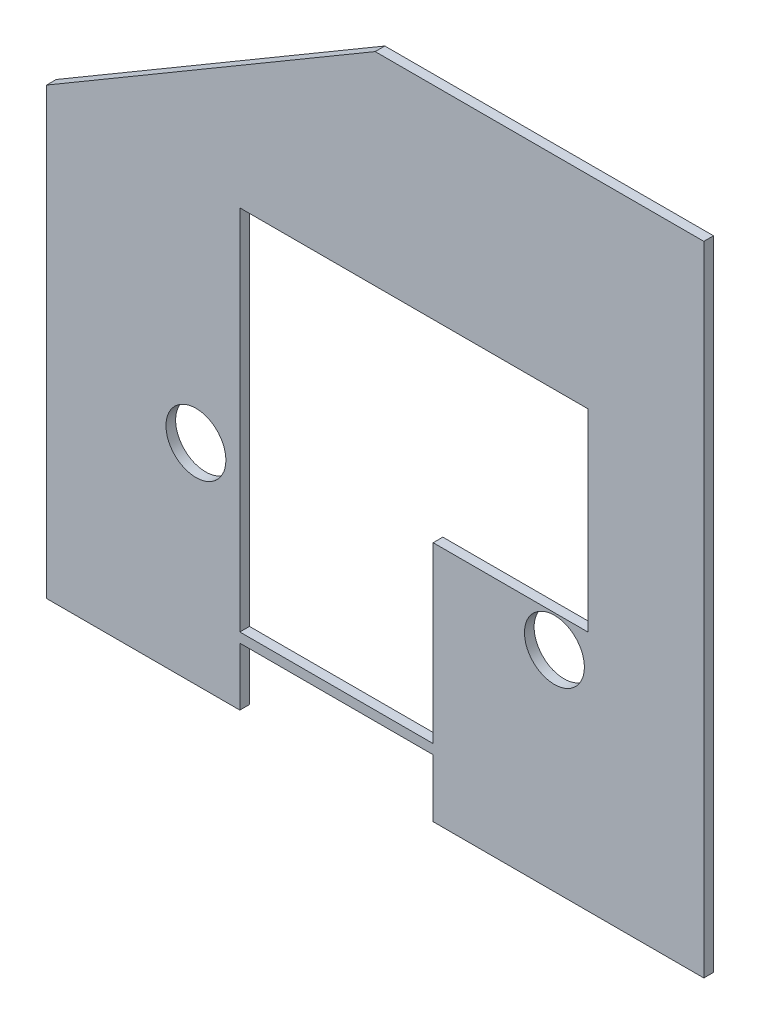
ISO-10303-21;
HEADER;
FILE_DESCRIPTION(('STEP AP214'),'2;1');
FILE_NAME('part.step','',(''),(''),'','','');
FILE_SCHEMA(('AUTOMOTIVE_DESIGN { 1 0 10303 214 1 1 1 1 }'));
ENDSEC;
DATA;
#1=APPLICATION_CONTEXT('core data for automotive mechanical design processes');
#2=APPLICATION_PROTOCOL_DEFINITION('international standard','automotive_design',2000,#1);
#3=PRODUCT_CONTEXT('',#1,'mechanical');
#4=PRODUCT('Part','Part','',(#3));
#5=PRODUCT_RELATED_PRODUCT_CATEGORY('part','',(#4));
#6=PRODUCT_DEFINITION_FORMATION('','',#4);
#7=PRODUCT_DEFINITION_CONTEXT('part definition',#1,'design');
#8=PRODUCT_DEFINITION('design','',#6,#7);
#9=PRODUCT_DEFINITION_SHAPE('','',#8);
#10=(LENGTH_UNIT() NAMED_UNIT(*) SI_UNIT(.MILLI.,.METRE.));
#11=(NAMED_UNIT(*) PLANE_ANGLE_UNIT() SI_UNIT($,.RADIAN.));
#12=(NAMED_UNIT(*) SI_UNIT($,.STERADIAN.) SOLID_ANGLE_UNIT());
#13=UNCERTAINTY_MEASURE_WITH_UNIT(LENGTH_MEASURE(1.E-05),#10,'distance_accuracy_value','');
#14=(GEOMETRIC_REPRESENTATION_CONTEXT(3) GLOBAL_UNCERTAINTY_ASSIGNED_CONTEXT((#13)) GLOBAL_UNIT_ASSIGNED_CONTEXT((#10,
#11,#12)) REPRESENTATION_CONTEXT('',''));
#15=CARTESIAN_POINT('',(0.,0.,0.));
#16=DIRECTION('',(0.,0.,1.));
#17=DIRECTION('',(1.,0.,0.));
#18=AXIS2_PLACEMENT_3D('',#15,#16,#17);
#19=CARTESIAN_POINT('',(431.8,12.7,6.35));
#20=DIRECTION('',(-1.,0.,0.));
#21=DIRECTION('',(0.,-1.,0.));
#22=AXIS2_PLACEMENT_3D('',#19,#20,#21);
#23=PLANE('',#22);
#24=DIRECTION('',(0.,1.,0.));
#25=VECTOR('',#24,1.);
#26=CARTESIAN_POINT('',(431.8,12.7,0.));
#27=LINE('',#26,#25);
#28=CARTESIAN_POINT('',(431.8,12.7,0.));
#29=VERTEX_POINT('',#28);
#30=CARTESIAN_POINT('',(431.8,431.8,0.));
#31=VERTEX_POINT('',#30);
#32=EDGE_CURVE('E203',#29,#31,#27,.T.);
#33=ORIENTED_EDGE('',*,*,#32,.T.);
#34=DIRECTION('',(0.,0.,-1.));
#35=VECTOR('',#34,1.);
#36=CARTESIAN_POINT('',(431.8,431.8,6.35));
#37=LINE('',#36,#35);
#38=CARTESIAN_POINT('',(431.8,431.8,6.35));
#39=VERTEX_POINT('',#38);
#40=EDGE_CURVE('E11',#39,#31,#37,.T.);
#41=ORIENTED_EDGE('',*,*,#40,.F.);
#42=DIRECTION('',(0.,1.,0.));
#43=VECTOR('',#42,1.);
#44=CARTESIAN_POINT('',(431.8,12.7,6.35));
#45=LINE('',#44,#43);
#46=CARTESIAN_POINT('',(431.8,12.7,6.35));
#47=VERTEX_POINT('',#46);
#48=EDGE_CURVE('E206',#47,#39,#45,.T.);
#49=ORIENTED_EDGE('',*,*,#48,.F.);
#50=DIRECTION('',(0.,0.,-1.));
#51=VECTOR('',#50,1.);
#52=CARTESIAN_POINT('',(431.8,12.7,6.35));
#53=LINE('',#52,#51);
#54=EDGE_CURVE('E226',#47,#29,#53,.T.);
#55=ORIENTED_EDGE('',*,*,#54,.T.);
#56=EDGE_LOOP('',(#33,#41,#49,#55));
#57=FACE_BOUND('',#56,.T.);
#58=ADVANCED_FACE('F35',(#57),#23,.F.);
#59=CARTESIAN_POINT('',(215.9,431.8,6.35));
#60=DIRECTION('',(0.,-1.,0.));
#61=DIRECTION('',(0.,0.,-1.));
#62=AXIS2_PLACEMENT_3D('',#59,#60,#61);
#63=PLANE('',#62);
#64=DIRECTION('',(-1.,0.,0.));
#65=VECTOR('',#64,1.);
#66=CARTESIAN_POINT('',(215.9,431.8,0.));
#67=LINE('',#66,#65);
#68=CARTESIAN_POINT('',(215.9,431.8,0.));
#69=VERTEX_POINT('',#68);
#70=EDGE_CURVE('E229',#31,#69,#67,.T.);
#71=ORIENTED_EDGE('',*,*,#70,.T.);
#72=DIRECTION('',(0.,0.,-1.));
#73=VECTOR('',#72,1.);
#74=CARTESIAN_POINT('',(215.9,431.8,6.35));
#75=LINE('',#74,#73);
#76=CARTESIAN_POINT('',(215.9,431.8,6.35));
#77=VERTEX_POINT('',#76);
#78=EDGE_CURVE('E42',#77,#69,#75,.T.);
#79=ORIENTED_EDGE('',*,*,#78,.F.);
#80=DIRECTION('',(-1.,0.,0.));
#81=VECTOR('',#80,1.);
#82=CARTESIAN_POINT('',(215.9,431.8,6.35));
#83=LINE('',#82,#81);
#84=EDGE_CURVE('E209',#39,#77,#83,.T.);
#85=ORIENTED_EDGE('',*,*,#84,.F.);
#86=ORIENTED_EDGE('',*,*,#40,.T.);
#87=EDGE_LOOP('',(#71,#79,#85,#86));
#88=FACE_BOUND('',#87,.T.);
#89=ADVANCED_FACE('F290',(#88),#63,.F.);
#90=CARTESIAN_POINT('',(0.,304.8,6.35));
#91=DIRECTION('',(0.507020126563394,-0.861934215157769,0.));
#92=DIRECTION('',(0.86193421515777,0.507020126563394,0.));
#93=AXIS2_PLACEMENT_3D('',#90,#91,#92);
#94=PLANE('',#93);
#95=DIRECTION('',(-0.861934215157769,-0.507020126563394,0.));
#96=VECTOR('',#95,1.);
#97=CARTESIAN_POINT('',(0.,304.8,0.));
#98=LINE('',#97,#96);
#99=CARTESIAN_POINT('',(0.,304.8,0.));
#100=VERTEX_POINT('',#99);
#101=EDGE_CURVE('E231',#69,#100,#98,.T.);
#102=ORIENTED_EDGE('',*,*,#101,.T.);
#103=DIRECTION('',(0.,0.,-1.));
#104=VECTOR('',#103,1.);
#105=CARTESIAN_POINT('',(0.,304.8,6.35));
#106=LINE('',#105,#104);
#107=CARTESIAN_POINT('',(0.,304.8,6.35));
#108=VERTEX_POINT('',#107);
#109=EDGE_CURVE('E261',#108,#100,#106,.T.);
#110=ORIENTED_EDGE('',*,*,#109,.F.);
#111=DIRECTION('',(-0.861934215157769,-0.507020126563394,0.));
#112=VECTOR('',#111,1.);
#113=CARTESIAN_POINT('',(0.,304.8,6.35));
#114=LINE('',#113,#112);
#115=EDGE_CURVE('E212',#77,#108,#114,.T.);
#116=ORIENTED_EDGE('',*,*,#115,.F.);
#117=ORIENTED_EDGE('',*,*,#78,.T.);
#118=EDGE_LOOP('',(#102,#110,#116,#117));
#119=FACE_BOUND('',#118,.T.);
#120=ADVANCED_FACE('F268',(#119),#94,.F.);
#121=CARTESIAN_POINT('',(0.,304.8,6.35));
#122=DIRECTION('',(1.,0.,0.));
#123=DIRECTION('',(0.,1.,0.));
#124=AXIS2_PLACEMENT_3D('',#121,#122,#123);
#125=PLANE('',#124);
#126=DIRECTION('',(0.,-1.,0.));
#127=VECTOR('',#126,1.);
#128=CARTESIAN_POINT('',(0.,304.8,0.));
#129=LINE('',#128,#127);
#130=CARTESIAN_POINT('',(0.,12.7,0.));
#131=VERTEX_POINT('',#130);
#132=EDGE_CURVE('E233',#100,#131,#129,.T.);
#133=ORIENTED_EDGE('',*,*,#132,.T.);
#134=DIRECTION('',(0.,0.,-1.));
#135=VECTOR('',#134,1.);
#136=CARTESIAN_POINT('',(0.,12.7,6.35));
#137=LINE('',#136,#135);
#138=CARTESIAN_POINT('',(0.,12.7,6.35));
#139=VERTEX_POINT('',#138);
#140=EDGE_CURVE('E258',#139,#131,#137,.T.);
#141=ORIENTED_EDGE('',*,*,#140,.F.);
#142=DIRECTION('',(0.,-1.,0.));
#143=VECTOR('',#142,1.);
#144=CARTESIAN_POINT('',(0.,304.8,6.35));
#145=LINE('',#144,#143);
#146=EDGE_CURVE('E214',#108,#139,#145,.T.);
#147=ORIENTED_EDGE('',*,*,#146,.F.);
#148=ORIENTED_EDGE('',*,*,#109,.T.);
#149=EDGE_LOOP('',(#133,#141,#147,#148));
#150=FACE_BOUND('',#149,.T.);
#151=ADVANCED_FACE('F278',(#150),#125,.F.);
#152=CARTESIAN_POINT('',(0.,12.7,6.35));
#153=DIRECTION('',(0.,1.,0.));
#154=DIRECTION('',(-1.,0.,0.));
#155=AXIS2_PLACEMENT_3D('',#152,#153,#154);
#156=PLANE('',#155);
#157=DIRECTION('',(1.,0.,0.));
#158=VECTOR('',#157,1.);
#159=CARTESIAN_POINT('',(0.,12.7,0.));
#160=LINE('',#159,#158);
#161=CARTESIAN_POINT('',(127.,12.7,0.));
#162=VERTEX_POINT('',#161);
#163=EDGE_CURVE('E235',#131,#162,#160,.T.);
#164=ORIENTED_EDGE('',*,*,#163,.T.);
#165=DIRECTION('',(0.,0.,-1.));
#166=VECTOR('',#165,1.);
#167=CARTESIAN_POINT('',(127.,12.7,6.35));
#168=LINE('',#167,#166);
#169=CARTESIAN_POINT('',(127.,12.7,6.35));
#170=VERTEX_POINT('',#169);
#171=EDGE_CURVE('E255',#170,#162,#168,.T.);
#172=ORIENTED_EDGE('',*,*,#171,.F.);
#173=DIRECTION('',(1.,0.,0.));
#174=VECTOR('',#173,1.);
#175=CARTESIAN_POINT('',(0.,12.7,6.35));
#176=LINE('',#175,#174);
#177=EDGE_CURVE('E216',#139,#170,#176,.T.);
#178=ORIENTED_EDGE('',*,*,#177,.F.);
#179=ORIENTED_EDGE('',*,*,#140,.T.);
#180=EDGE_LOOP('',(#164,#172,#178,#179));
#181=FACE_BOUND('',#180,.T.);
#182=ADVANCED_FACE('F282',(#181),#156,.F.);
#183=CARTESIAN_POINT('',(127.,12.7,6.35));
#184=DIRECTION('',(-1.,0.,0.));
#185=DIRECTION('',(0.,0.,1.));
#186=AXIS2_PLACEMENT_3D('',#183,#184,#185);
#187=PLANE('',#186);
#188=DIRECTION('',(0.,1.,0.));
#189=VECTOR('',#188,1.);
#190=CARTESIAN_POINT('',(127.,12.7,0.));
#191=LINE('',#190,#189);
#192=CARTESIAN_POINT('',(127.,50.8,0.));
#193=VERTEX_POINT('',#192);
#194=EDGE_CURVE('E237',#162,#193,#191,.T.);
#195=ORIENTED_EDGE('',*,*,#194,.T.);
#196=DIRECTION('',(0.,0.,-1.));
#197=VECTOR('',#196,1.);
#198=CARTESIAN_POINT('',(127.,50.8,6.35));
#199=LINE('',#198,#197);
#200=CARTESIAN_POINT('',(127.,50.8,6.35));
#201=VERTEX_POINT('',#200);
#202=EDGE_CURVE('E252',#201,#193,#199,.T.);
#203=ORIENTED_EDGE('',*,*,#202,.F.);
#204=DIRECTION('',(0.,1.,0.));
#205=VECTOR('',#204,1.);
#206=CARTESIAN_POINT('',(127.,12.7,6.35));
#207=LINE('',#206,#205);
#208=EDGE_CURVE('E218',#170,#201,#207,.T.);
#209=ORIENTED_EDGE('',*,*,#208,.F.);
#210=ORIENTED_EDGE('',*,*,#171,.T.);
#211=EDGE_LOOP('',(#195,#203,#209,#210));
#212=FACE_BOUND('',#211,.T.);
#213=ADVANCED_FACE('F308',(#212),#187,.F.);
#214=CARTESIAN_POINT('',(254.,50.8,6.35));
#215=DIRECTION('',(0.,1.,0.));
#216=DIRECTION('',(-1.,0.,0.));
#217=AXIS2_PLACEMENT_3D('',#214,#215,#216);
#218=PLANE('',#217);
#219=DIRECTION('',(1.,0.,0.));
#220=VECTOR('',#219,1.);
#221=CARTESIAN_POINT('',(254.,50.8,0.));
#222=LINE('',#221,#220);
#223=CARTESIAN_POINT('',(254.,50.8,0.));
#224=VERTEX_POINT('',#223);
#225=EDGE_CURVE('E239',#193,#224,#222,.T.);
#226=ORIENTED_EDGE('',*,*,#225,.T.);
#227=DIRECTION('',(0.,0.,-1.));
#228=VECTOR('',#227,1.);
#229=CARTESIAN_POINT('',(254.,50.8,6.35));
#230=LINE('',#229,#228);
#231=CARTESIAN_POINT('',(254.,50.8,6.35));
#232=VERTEX_POINT('',#231);
#233=EDGE_CURVE('E249',#232,#224,#230,.T.);
#234=ORIENTED_EDGE('',*,*,#233,.F.);
#235=DIRECTION('',(1.,0.,0.));
#236=VECTOR('',#235,1.);
#237=CARTESIAN_POINT('',(254.,50.8,6.35));
#238=LINE('',#237,#236);
#239=EDGE_CURVE('E220',#201,#232,#238,.T.);
#240=ORIENTED_EDGE('',*,*,#239,.F.);
#241=ORIENTED_EDGE('',*,*,#202,.T.);
#242=EDGE_LOOP('',(#226,#234,#240,#241));
#243=FACE_BOUND('',#242,.T.);
#244=ADVANCED_FACE('F306',(#243),#218,.F.);
#245=CARTESIAN_POINT('',(254.,50.8,6.35));
#246=DIRECTION('',(1.,0.,0.));
#247=DIRECTION('',(0.,1.,0.));
#248=AXIS2_PLACEMENT_3D('',#245,#246,#247);
#249=PLANE('',#248);
#250=DIRECTION('',(0.,-1.,0.));
#251=VECTOR('',#250,1.);
#252=CARTESIAN_POINT('',(254.,50.8,0.));
#253=LINE('',#252,#251);
#254=CARTESIAN_POINT('',(254.,12.7,0.));
#255=VERTEX_POINT('',#254);
#256=EDGE_CURVE('E241',#224,#255,#253,.T.);
#257=ORIENTED_EDGE('',*,*,#256,.T.);
#258=DIRECTION('',(0.,0.,-1.));
#259=VECTOR('',#258,1.);
#260=CARTESIAN_POINT('',(254.,12.7,6.35));
#261=LINE('',#260,#259);
#262=CARTESIAN_POINT('',(254.,12.7,6.35));
#263=VERTEX_POINT('',#262);
#264=EDGE_CURVE('E246',#263,#255,#261,.T.);
#265=ORIENTED_EDGE('',*,*,#264,.F.);
#266=DIRECTION('',(0.,-1.,0.));
#267=VECTOR('',#266,1.);
#268=CARTESIAN_POINT('',(254.,50.8,6.35));
#269=LINE('',#268,#267);
#270=EDGE_CURVE('E222',#232,#263,#269,.T.);
#271=ORIENTED_EDGE('',*,*,#270,.F.);
#272=ORIENTED_EDGE('',*,*,#233,.T.);
#273=EDGE_LOOP('',(#257,#265,#271,#272));
#274=FACE_BOUND('',#273,.T.);
#275=ADVANCED_FACE('F302',(#274),#249,.F.);
#276=CARTESIAN_POINT('',(254.,12.7,6.35));
#277=DIRECTION('',(0.,1.,0.));
#278=DIRECTION('',(-1.,0.,0.));
#279=AXIS2_PLACEMENT_3D('',#276,#277,#278);
#280=PLANE('',#279);
#281=DIRECTION('',(1.,0.,0.));
#282=VECTOR('',#281,1.);
#283=CARTESIAN_POINT('',(254.,12.7,0.));
#284=LINE('',#283,#282);
#285=EDGE_CURVE('E210',#255,#29,#284,.T.);
#286=ORIENTED_EDGE('',*,*,#285,.T.);
#287=ORIENTED_EDGE('',*,*,#54,.F.);
#288=DIRECTION('',(1.,0.,0.));
#289=VECTOR('',#288,1.);
#290=CARTESIAN_POINT('',(254.,12.7,6.35));
#291=LINE('',#290,#289);
#292=EDGE_CURVE('E224',#263,#47,#291,.T.);
#293=ORIENTED_EDGE('',*,*,#292,.F.);
#294=ORIENTED_EDGE('',*,*,#264,.T.);
#295=EDGE_LOOP('',(#286,#287,#293,#294));
#296=FACE_BOUND('',#295,.T.);
#297=ADVANCED_FACE('F297',(#296),#280,.F.);
#298=CARTESIAN_POINT('',(0.,0.,6.35));
#299=DIRECTION('',(0.,0.,-1.));
#300=DIRECTION('',(-1.,0.,0.));
#301=AXIS2_PLACEMENT_3D('',#298,#299,#300);
#302=PLANE('',#301);
#303=DIRECTION('',(0.,-1.,0.));
#304=VECTOR('',#303,1.);
#305=CARTESIAN_POINT('',(127.,298.45,6.35));
#306=LINE('',#305,#304);
#307=CARTESIAN_POINT('',(127.,298.45,6.35));
#308=VERTEX_POINT('',#307);
#309=CARTESIAN_POINT('',(127.,57.15,6.35));
#310=VERTEX_POINT('',#309);
#311=EDGE_CURVE('E174',#308,#310,#306,.T.);
#312=ORIENTED_EDGE('',*,*,#311,.F.);
#313=DIRECTION('',(-1.,0.,0.));
#314=VECTOR('',#313,1.);
#315=CARTESIAN_POINT('',(355.6,298.45,6.35));
#316=LINE('',#315,#314);
#317=CARTESIAN_POINT('',(355.6,298.45,6.35));
#318=VERTEX_POINT('',#317);
#319=EDGE_CURVE('E49',#318,#308,#316,.T.);
#320=ORIENTED_EDGE('',*,*,#319,.F.);
#321=DIRECTION('',(0.,1.,0.));
#322=VECTOR('',#321,1.);
#323=CARTESIAN_POINT('',(355.6,171.45,6.35));
#324=LINE('',#323,#322);
#325=CARTESIAN_POINT('',(355.6,171.45,6.35));
#326=VERTEX_POINT('',#325);
#327=EDGE_CURVE('E160',#326,#318,#324,.T.);
#328=ORIENTED_EDGE('',*,*,#327,.F.);
#329=DIRECTION('',(1.,0.,0.));
#330=VECTOR('',#329,1.);
#331=CARTESIAN_POINT('',(254.,171.45,6.35));
#332=LINE('',#331,#330);
#333=CARTESIAN_POINT('',(254.,171.45,6.35));
#334=VERTEX_POINT('',#333);
#335=EDGE_CURVE('E163',#334,#326,#332,.T.);
#336=ORIENTED_EDGE('',*,*,#335,.F.);
#337=DIRECTION('',(0.,1.,0.));
#338=VECTOR('',#337,1.);
#339=CARTESIAN_POINT('',(254.,57.15,6.35));
#340=LINE('',#339,#338);
#341=CARTESIAN_POINT('',(254.,57.15,6.35));
#342=VERTEX_POINT('',#341);
#343=EDGE_CURVE('E179',#342,#334,#340,.T.);
#344=ORIENTED_EDGE('',*,*,#343,.F.);
#345=DIRECTION('',(1.,0.,0.));
#346=VECTOR('',#345,1.);
#347=CARTESIAN_POINT('',(127.,57.15,6.35));
#348=LINE('',#347,#346);
#349=EDGE_CURVE('E176',#310,#342,#348,.T.);
#350=ORIENTED_EDGE('',*,*,#349,.F.);
#351=EDGE_LOOP('',(#312,#320,#328,#336,#344,#350));
#352=FACE_BOUND('',#351,.T.);
#353=CARTESIAN_POINT('',(333.65,150.3,6.35));
#354=DIRECTION('',(0.,0.,1.));
#355=DIRECTION('',(1.,0.,0.));
#356=AXIS2_PLACEMENT_3D('',#353,#354,#355);
#357=CIRCLE('',#356,19.685);
#358=CARTESIAN_POINT('',(353.335,150.3,6.35));
#359=VERTEX_POINT('',#358);
#360=EDGE_CURVE('E186',#359,#359,#357,.T.);
#361=ORIENTED_EDGE('',*,*,#360,.F.);
#362=EDGE_LOOP('',(#361));
#363=FACE_BOUND('',#362,.T.);
#364=CARTESIAN_POINT('',(98.15,150.3,6.35));
#365=DIRECTION('',(0.,0.,1.));
#366=DIRECTION('',(1.,0.,0.));
#367=AXIS2_PLACEMENT_3D('',#364,#365,#366);
#368=CIRCLE('',#367,19.685);
#369=CARTESIAN_POINT('',(117.835,150.3,6.35));
#370=VERTEX_POINT('',#369);
#371=EDGE_CURVE('E197',#370,#370,#368,.T.);
#372=ORIENTED_EDGE('',*,*,#371,.F.);
#373=EDGE_LOOP('',(#372));
#374=FACE_BOUND('',#373,.T.);
#375=ORIENTED_EDGE('',*,*,#48,.T.);
#376=ORIENTED_EDGE('',*,*,#84,.T.);
#377=ORIENTED_EDGE('',*,*,#115,.T.);
#378=ORIENTED_EDGE('',*,*,#146,.T.);
#379=ORIENTED_EDGE('',*,*,#177,.T.);
#380=ORIENTED_EDGE('',*,*,#208,.T.);
#381=ORIENTED_EDGE('',*,*,#239,.T.);
#382=ORIENTED_EDGE('',*,*,#270,.T.);
#383=ORIENTED_EDGE('',*,*,#292,.T.);
#384=EDGE_LOOP('',(#375,#376,#377,#378,#379,#380,#381,#382,#383));
#385=FACE_BOUND('',#384,.T.);
#386=ADVANCED_FACE('F286',(#352,#363,#374,#385),#302,.F.);
#387=CARTESIAN_POINT('',(0.,0.,0.));
#388=DIRECTION('',(0.,0.,-1.));
#389=DIRECTION('',(-1.,0.,0.));
#390=AXIS2_PLACEMENT_3D('',#387,#388,#389);
#391=PLANE('',#390);
#392=DIRECTION('',(-1.,0.,0.));
#393=VECTOR('',#392,1.);
#394=CARTESIAN_POINT('',(355.6,298.45,0.));
#395=LINE('',#394,#393);
#396=CARTESIAN_POINT('',(355.6,298.45,0.));
#397=VERTEX_POINT('',#396);
#398=CARTESIAN_POINT('',(127.,298.45,0.));
#399=VERTEX_POINT('',#398);
#400=EDGE_CURVE('E143',#397,#399,#395,.T.);
#401=ORIENTED_EDGE('',*,*,#400,.T.);
#402=DIRECTION('',(0.,-1.,0.));
#403=VECTOR('',#402,1.);
#404=CARTESIAN_POINT('',(127.,298.45,0.));
#405=LINE('',#404,#403);
#406=CARTESIAN_POINT('',(127.,57.15,0.));
#407=VERTEX_POINT('',#406);
#408=EDGE_CURVE('E152',#399,#407,#405,.T.);
#409=ORIENTED_EDGE('',*,*,#408,.T.);
#410=DIRECTION('',(1.,0.,0.));
#411=VECTOR('',#410,1.);
#412=CARTESIAN_POINT('',(127.,57.15,0.));
#413=LINE('',#412,#411);
#414=CARTESIAN_POINT('',(254.,57.15,0.));
#415=VERTEX_POINT('',#414);
#416=EDGE_CURVE('E57',#407,#415,#413,.T.);
#417=ORIENTED_EDGE('',*,*,#416,.T.);
#418=DIRECTION('',(0.,1.,0.));
#419=VECTOR('',#418,1.);
#420=CARTESIAN_POINT('',(254.,57.15,0.));
#421=LINE('',#420,#419);
#422=CARTESIAN_POINT('',(254.,171.45,0.));
#423=VERTEX_POINT('',#422);
#424=EDGE_CURVE('E167',#415,#423,#421,.T.);
#425=ORIENTED_EDGE('',*,*,#424,.T.);
#426=DIRECTION('',(1.,0.,0.));
#427=VECTOR('',#426,1.);
#428=CARTESIAN_POINT('',(254.,171.45,0.));
#429=LINE('',#428,#427);
#430=CARTESIAN_POINT('',(355.6,171.45,0.));
#431=VERTEX_POINT('',#430);
#432=EDGE_CURVE('E170',#423,#431,#429,.T.);
#433=ORIENTED_EDGE('',*,*,#432,.T.);
#434=DIRECTION('',(0.,1.,0.));
#435=VECTOR('',#434,1.);
#436=CARTESIAN_POINT('',(355.6,171.45,0.));
#437=LINE('',#436,#435);
#438=EDGE_CURVE('E149',#431,#397,#437,.T.);
#439=ORIENTED_EDGE('',*,*,#438,.T.);
#440=EDGE_LOOP('',(#401,#409,#417,#425,#433,#439));
#441=FACE_BOUND('',#440,.T.);
#442=CARTESIAN_POINT('',(333.65,150.3,0.));
#443=DIRECTION('',(0.,0.,1.));
#444=DIRECTION('',(1.,0.,0.));
#445=AXIS2_PLACEMENT_3D('',#442,#443,#444);
#446=CIRCLE('',#445,19.685);
#447=CARTESIAN_POINT('',(353.335,150.3,0.));
#448=VERTEX_POINT('',#447);
#449=EDGE_CURVE('E194',#448,#448,#446,.T.);
#450=ORIENTED_EDGE('',*,*,#449,.T.);
#451=EDGE_LOOP('',(#450));
#452=FACE_BOUND('',#451,.T.);
#453=CARTESIAN_POINT('',(98.15,150.3,0.));
#454=DIRECTION('',(0.,0.,1.));
#455=DIRECTION('',(1.,0.,0.));
#456=AXIS2_PLACEMENT_3D('',#453,#454,#455);
#457=CIRCLE('',#456,19.685);
#458=CARTESIAN_POINT('',(117.835,150.3,0.));
#459=VERTEX_POINT('',#458);
#460=EDGE_CURVE('E200',#459,#459,#457,.T.);
#461=ORIENTED_EDGE('',*,*,#460,.T.);
#462=EDGE_LOOP('',(#461));
#463=FACE_BOUND('',#462,.T.);
#464=ORIENTED_EDGE('',*,*,#32,.F.);
#465=ORIENTED_EDGE('',*,*,#285,.F.);
#466=ORIENTED_EDGE('',*,*,#256,.F.);
#467=ORIENTED_EDGE('',*,*,#225,.F.);
#468=ORIENTED_EDGE('',*,*,#194,.F.);
#469=ORIENTED_EDGE('',*,*,#163,.F.);
#470=ORIENTED_EDGE('',*,*,#132,.F.);
#471=ORIENTED_EDGE('',*,*,#101,.F.);
#472=ORIENTED_EDGE('',*,*,#70,.F.);
#473=EDGE_LOOP('',(#464,#465,#466,#467,#468,#469,#470,#471,#472));
#474=FACE_BOUND('',#473,.T.);
#475=ADVANCED_FACE('F156',(#441,#452,#463,#474),#391,.T.);
#476=CARTESIAN_POINT('',(98.15,150.3,0.));
#477=DIRECTION('',(0.,0.,1.));
#478=DIRECTION('',(1.,0.,0.));
#479=AXIS2_PLACEMENT_3D('',#476,#477,#478);
#480=CYLINDRICAL_SURFACE('',#479,19.685);
#481=ORIENTED_EDGE('',*,*,#460,.F.);
#482=EDGE_LOOP('',(#481));
#483=FACE_BOUND('',#482,.T.);
#484=ORIENTED_EDGE('',*,*,#371,.T.);
#485=EDGE_LOOP('',(#484));
#486=FACE_BOUND('',#485,.T.);
#487=ADVANCED_FACE('F382',(#483,#486),#480,.F.);
#488=CARTESIAN_POINT('',(333.65,150.3,0.));
#489=DIRECTION('',(0.,0.,1.));
#490=DIRECTION('',(1.,0.,0.));
#491=AXIS2_PLACEMENT_3D('',#488,#489,#490);
#492=CYLINDRICAL_SURFACE('',#491,19.685);
#493=ORIENTED_EDGE('',*,*,#449,.F.);
#494=EDGE_LOOP('',(#493));
#495=FACE_BOUND('',#494,.T.);
#496=ORIENTED_EDGE('',*,*,#360,.T.);
#497=EDGE_LOOP('',(#496));
#498=FACE_BOUND('',#497,.T.);
#499=ADVANCED_FACE('F390',(#495,#498),#492,.F.);
#500=CARTESIAN_POINT('',(355.6,298.45,0.));
#501=DIRECTION('',(0.,1.,0.));
#502=DIRECTION('',(-1.,0.,0.));
#503=AXIS2_PLACEMENT_3D('',#500,#501,#502);
#504=PLANE('',#503);
#505=ORIENTED_EDGE('',*,*,#319,.T.);
#506=DIRECTION('',(0.,0.,1.));
#507=VECTOR('',#506,1.);
#508=CARTESIAN_POINT('',(127.,298.45,0.));
#509=LINE('',#508,#507);
#510=EDGE_CURVE('E139',#399,#308,#509,.T.);
#511=ORIENTED_EDGE('',*,*,#510,.F.);
#512=ORIENTED_EDGE('',*,*,#400,.F.);
#513=DIRECTION('',(0.,0.,1.));
#514=VECTOR('',#513,1.);
#515=CARTESIAN_POINT('',(355.6,298.45,0.));
#516=LINE('',#515,#514);
#517=EDGE_CURVE('E184',#397,#318,#516,.T.);
#518=ORIENTED_EDGE('',*,*,#517,.T.);
#519=EDGE_LOOP('',(#505,#511,#512,#518));
#520=FACE_BOUND('',#519,.T.);
#521=ADVANCED_FACE('F141',(#520),#504,.F.);
#522=CARTESIAN_POINT('',(355.6,171.45,0.));
#523=DIRECTION('',(1.,0.,0.));
#524=DIRECTION('',(0.,0.,-1.));
#525=AXIS2_PLACEMENT_3D('',#522,#523,#524);
#526=PLANE('',#525);
#527=ORIENTED_EDGE('',*,*,#327,.T.);
#528=ORIENTED_EDGE('',*,*,#517,.F.);
#529=ORIENTED_EDGE('',*,*,#438,.F.);
#530=DIRECTION('',(0.,0.,1.));
#531=VECTOR('',#530,1.);
#532=CARTESIAN_POINT('',(355.6,171.45,0.));
#533=LINE('',#532,#531);
#534=EDGE_CURVE('E187',#431,#326,#533,.T.);
#535=ORIENTED_EDGE('',*,*,#534,.T.);
#536=EDGE_LOOP('',(#527,#528,#529,#535));
#537=FACE_BOUND('',#536,.T.);
#538=ADVANCED_FACE('F410',(#537),#526,.F.);
#539=CARTESIAN_POINT('',(254.,171.45,0.));
#540=DIRECTION('',(0.,-1.,0.));
#541=DIRECTION('',(0.,0.,-1.));
#542=AXIS2_PLACEMENT_3D('',#539,#540,#541);
#543=PLANE('',#542);
#544=ORIENTED_EDGE('',*,*,#335,.T.);
#545=ORIENTED_EDGE('',*,*,#534,.F.);
#546=ORIENTED_EDGE('',*,*,#432,.F.);
#547=DIRECTION('',(0.,0.,1.));
#548=VECTOR('',#547,1.);
#549=CARTESIAN_POINT('',(254.,171.45,0.));
#550=LINE('',#549,#548);
#551=EDGE_CURVE('E189',#423,#334,#550,.T.);
#552=ORIENTED_EDGE('',*,*,#551,.T.);
#553=EDGE_LOOP('',(#544,#545,#546,#552));
#554=FACE_BOUND('',#553,.T.);
#555=ADVANCED_FACE('F418',(#554),#543,.F.);
#556=CARTESIAN_POINT('',(254.,57.15,0.));
#557=DIRECTION('',(1.,0.,0.));
#558=DIRECTION('',(0.,0.,-1.));
#559=AXIS2_PLACEMENT_3D('',#556,#557,#558);
#560=PLANE('',#559);
#561=ORIENTED_EDGE('',*,*,#343,.T.);
#562=ORIENTED_EDGE('',*,*,#551,.F.);
#563=ORIENTED_EDGE('',*,*,#424,.F.);
#564=DIRECTION('',(0.,0.,1.));
#565=VECTOR('',#564,1.);
#566=CARTESIAN_POINT('',(254.,57.15,0.));
#567=LINE('',#566,#565);
#568=EDGE_CURVE('E191',#415,#342,#567,.T.);
#569=ORIENTED_EDGE('',*,*,#568,.T.);
#570=EDGE_LOOP('',(#561,#562,#563,#569));
#571=FACE_BOUND('',#570,.T.);
#572=ADVANCED_FACE('F427',(#571),#560,.F.);
#573=CARTESIAN_POINT('',(127.,57.15,0.));
#574=DIRECTION('',(0.,-1.,0.));
#575=DIRECTION('',(0.,0.,-1.));
#576=AXIS2_PLACEMENT_3D('',#573,#574,#575);
#577=PLANE('',#576);
#578=ORIENTED_EDGE('',*,*,#349,.T.);
#579=ORIENTED_EDGE('',*,*,#568,.F.);
#580=ORIENTED_EDGE('',*,*,#416,.F.);
#581=DIRECTION('',(0.,0.,1.));
#582=VECTOR('',#581,1.);
#583=CARTESIAN_POINT('',(127.,57.15,0.));
#584=LINE('',#583,#582);
#585=EDGE_CURVE('E148',#407,#310,#584,.T.);
#586=ORIENTED_EDGE('',*,*,#585,.T.);
#587=EDGE_LOOP('',(#578,#579,#580,#586));
#588=FACE_BOUND('',#587,.T.);
#589=ADVANCED_FACE('F436',(#588),#577,.F.);
#590=CARTESIAN_POINT('',(127.,298.45,0.));
#591=DIRECTION('',(-1.,0.,0.));
#592=DIRECTION('',(0.,-1.,0.));
#593=AXIS2_PLACEMENT_3D('',#590,#591,#592);
#594=PLANE('',#593);
#595=ORIENTED_EDGE('',*,*,#311,.T.);
#596=ORIENTED_EDGE('',*,*,#585,.F.);
#597=ORIENTED_EDGE('',*,*,#408,.F.);
#598=ORIENTED_EDGE('',*,*,#510,.T.);
#599=EDGE_LOOP('',(#595,#596,#597,#598));
#600=FACE_BOUND('',#599,.T.);
#601=ADVANCED_FACE('F153',(#600),#594,.F.);
#602=CLOSED_SHELL('',(#58,#89,#120,#151,#182,#213,#244,#275,#297,#386,#475,#487,#499,#521,#538,
#555,#572,#589,#601));
#603=MANIFOLD_SOLID_BREP('B2',#602);
#604=ADVANCED_BREP_SHAPE_REPRESENTATION('',(#18,#603),#14);
#605=SHAPE_DEFINITION_REPRESENTATION(#9,#604);
ENDSEC;
END-ISO-10303-21;
